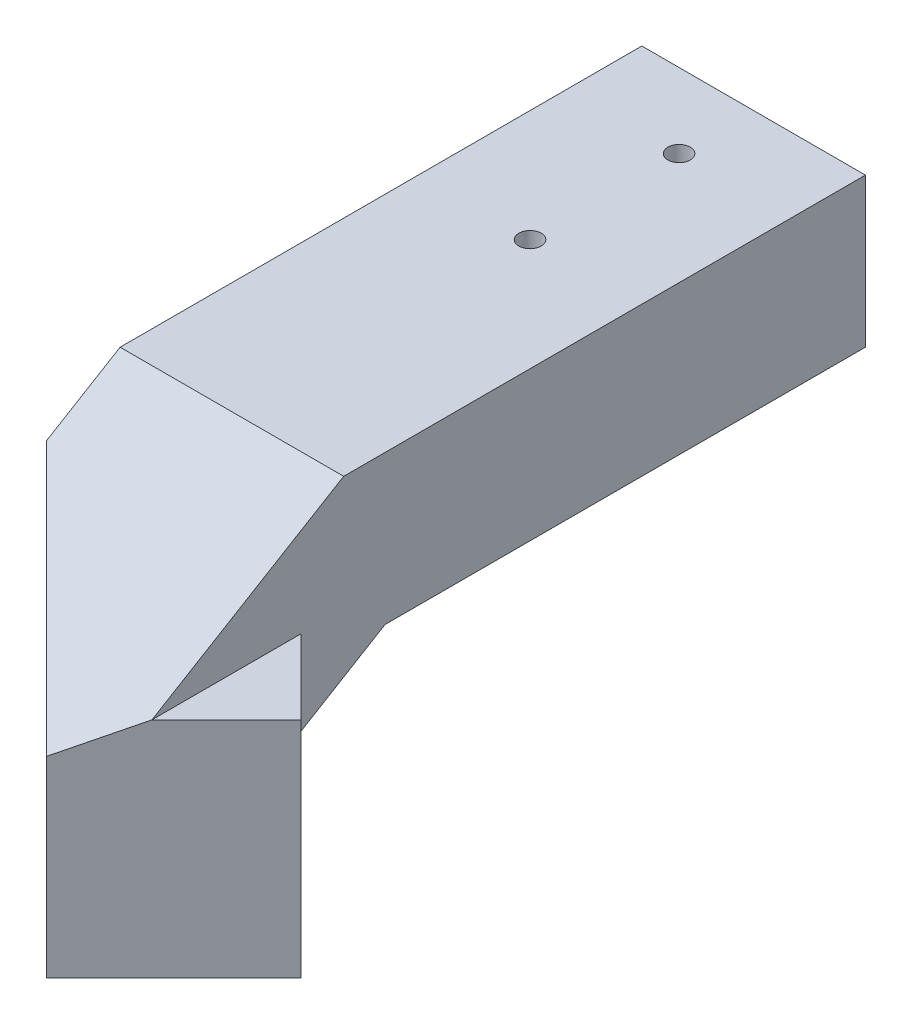
ISO-10303-21;
HEADER;
FILE_DESCRIPTION(('STEP AP214'),'2;1');
FILE_NAME('part.step','',(''),(''),'','','');
FILE_SCHEMA(('AUTOMOTIVE_DESIGN { 1 0 10303 214 1 1 1 1 }'));
ENDSEC;
DATA;
#1=APPLICATION_CONTEXT('core data for automotive mechanical design processes');
#2=APPLICATION_PROTOCOL_DEFINITION('international standard','automotive_design',2000,#1);
#3=PRODUCT_CONTEXT('',#1,'mechanical');
#4=PRODUCT('Part','Part','',(#3));
#5=PRODUCT_RELATED_PRODUCT_CATEGORY('part','',(#4));
#6=PRODUCT_DEFINITION_FORMATION('','',#4);
#7=PRODUCT_DEFINITION_CONTEXT('part definition',#1,'design');
#8=PRODUCT_DEFINITION('design','',#6,#7);
#9=PRODUCT_DEFINITION_SHAPE('','',#8);
#10=(LENGTH_UNIT() NAMED_UNIT(*) SI_UNIT(.MILLI.,.METRE.));
#11=(NAMED_UNIT(*) PLANE_ANGLE_UNIT() SI_UNIT($,.RADIAN.));
#12=(NAMED_UNIT(*) SI_UNIT($,.STERADIAN.) SOLID_ANGLE_UNIT());
#13=UNCERTAINTY_MEASURE_WITH_UNIT(LENGTH_MEASURE(1.E-05),#10,'distance_accuracy_value','');
#14=(GEOMETRIC_REPRESENTATION_CONTEXT(3) GLOBAL_UNCERTAINTY_ASSIGNED_CONTEXT((#13)) GLOBAL_UNIT_ASSIGNED_CONTEXT((#10,
#11,#12)) REPRESENTATION_CONTEXT('',''));
#15=CARTESIAN_POINT('',(0.,0.,0.));
#16=DIRECTION('',(0.,0.,1.));
#17=DIRECTION('',(1.,0.,0.));
#18=AXIS2_PLACEMENT_3D('',#15,#16,#17);
#19=CARTESIAN_POINT('',(30.,0.,0.));
#20=DIRECTION('',(0.,-1.,0.));
#21=DIRECTION('',(0.,0.,-1.));
#22=AXIS2_PLACEMENT_3D('',#19,#20,#21);
#23=PLANE('',#22);
#24=CARTESIAN_POINT('',(15.,0.,9.99999999999999));
#25=DIRECTION('',(0.,-1.,0.));
#26=DIRECTION('',(0.,0.,-1.));
#27=AXIS2_PLACEMENT_3D('',#24,#25,#26);
#28=CIRCLE('',#27,1.5);
#29=CARTESIAN_POINT('',(15.,0.,8.49999999999999));
#30=VERTEX_POINT('',#29);
#31=EDGE_CURVE('E262',#30,#30,#28,.T.);
#32=ORIENTED_EDGE('',*,*,#31,.T.);
#33=EDGE_LOOP('',(#32));
#34=FACE_BOUND('',#33,.T.);
#35=CARTESIAN_POINT('',(15.,0.,-10.));
#36=DIRECTION('',(0.,-1.,0.));
#37=DIRECTION('',(0.,0.,-1.));
#38=AXIS2_PLACEMENT_3D('',#35,#36,#37);
#39=CIRCLE('',#38,1.5);
#40=CARTESIAN_POINT('',(15.,0.,-11.5));
#41=VERTEX_POINT('',#40);
#42=EDGE_CURVE('E143',#41,#41,#39,.T.);
#43=ORIENTED_EDGE('',*,*,#42,.T.);
#44=EDGE_LOOP('',(#43));
#45=FACE_BOUND('',#44,.T.);
#46=DIRECTION('',(0.,0.,1.));
#47=VECTOR('',#46,1.);
#48=CARTESIAN_POINT('',(0.,0.,0.));
#49=LINE('',#48,#47);
#50=CARTESIAN_POINT('',(0.,0.,-20.));
#51=VERTEX_POINT('',#50);
#52=CARTESIAN_POINT('',(0.,0.,50.));
#53=VERTEX_POINT('',#52);
#54=EDGE_CURVE('E133',#51,#53,#49,.T.);
#55=ORIENTED_EDGE('',*,*,#54,.T.);
#56=DIRECTION('',(-1.,0.,0.));
#57=VECTOR('',#56,1.);
#58=CARTESIAN_POINT('',(30.,0.,50.));
#59=LINE('',#58,#57);
#60=CARTESIAN_POINT('',(30.,0.,50.));
#61=VERTEX_POINT('',#60);
#62=EDGE_CURVE('E218',#61,#53,#59,.T.);
#63=ORIENTED_EDGE('',*,*,#62,.F.);
#64=DIRECTION('',(0.,0.,1.));
#65=VECTOR('',#64,1.);
#66=CARTESIAN_POINT('',(30.,0.,0.));
#67=LINE('',#66,#65);
#68=CARTESIAN_POINT('',(30.,0.,-20.));
#69=VERTEX_POINT('',#68);
#70=EDGE_CURVE('E126',#69,#61,#67,.T.);
#71=ORIENTED_EDGE('',*,*,#70,.F.);
#72=DIRECTION('',(1.,0.,0.));
#73=VECTOR('',#72,1.);
#74=CARTESIAN_POINT('',(0.,0.,-20.));
#75=LINE('',#74,#73);
#76=EDGE_CURVE('E137',#51,#69,#75,.T.);
#77=ORIENTED_EDGE('',*,*,#76,.F.);
#78=EDGE_LOOP('',(#55,#63,#71,#77));
#79=FACE_BOUND('',#78,.T.);
#80=ADVANCED_FACE('F32',(#34,#45,#79),#23,.F.);
#81=CARTESIAN_POINT('',(30.,0.,50.));
#82=DIRECTION('',(0.,-0.857492925712545,-0.514495755427526));
#83=DIRECTION('',(0.,0.514495755427526,-0.857492925712545));
#84=AXIS2_PLACEMENT_3D('',#81,#82,#83);
#85=PLANE('',#84);
#86=ORIENTED_EDGE('',*,*,#62,.T.);
#87=DIRECTION('',(0.,0.514495755427526,-0.857492925712544));
#88=VECTOR('',#87,1.);
#89=CARTESIAN_POINT('',(0.,22.0588235294118,13.235294117647));
#90=LINE('',#89,#88);
#91=CARTESIAN_POINT('',(0.,-5.92015403706431,59.8669233951072));
#92=VERTEX_POINT('',#91);
#93=EDGE_CURVE('E45',#92,#53,#90,.T.);
#94=ORIENTED_EDGE('',*,*,#93,.F.);
#95=DIRECTION('',(0.650944554904118,-0.390566732942472,0.650944554904121));
#96=VECTOR('',#95,1.);
#97=CARTESIAN_POINT('',(-26.8724643293838,10.203324560566,32.9944590657233));
#98=LINE('',#97,#96);
#99=CARTESIAN_POINT('',(22.9289321881345,-19.6775133499451,82.7958555832418));
#100=VERTEX_POINT('',#99);
#101=EDGE_CURVE('E11',#92,#100,#98,.T.);
#102=ORIENTED_EDGE('',*,*,#101,.T.);
#103=DIRECTION('',(0.650944554904121,0.390566732942471,-0.650944554904118));
#104=VECTOR('',#103,1.);
#105=CARTESIAN_POINT('',(30.8474576271187,-14.9263980865546,74.8773301442577));
#106=LINE('',#105,#104);
#107=CARTESIAN_POINT('',(30.,-15.4348726628258,75.7247877713763));
#108=VERTEX_POINT('',#107);
#109=EDGE_CURVE('E152',#100,#108,#106,.T.);
#110=ORIENTED_EDGE('',*,*,#109,.T.);
#111=DIRECTION('',(0.,-0.514495755427526,0.857492925712544));
#112=VECTOR('',#111,1.);
#113=CARTESIAN_POINT('',(30.,0.,50.));
#114=LINE('',#113,#112);
#115=EDGE_CURVE('E208',#61,#108,#114,.T.);
#116=ORIENTED_EDGE('',*,*,#115,.F.);
#117=EDGE_LOOP('',(#86,#94,#102,#110,#116));
#118=FACE_BOUND('',#117,.T.);
#119=ADVANCED_FACE('F249',(#118),#85,.F.);
#120=CARTESIAN_POINT('',(30.,-45.4348726628258,75.7247877713763));
#121=DIRECTION('',(0.,1.,0.));
#122=DIRECTION('',(0.,0.,1.));
#123=AXIS2_PLACEMENT_3D('',#120,#121,#122);
#124=PLANE('',#123);
#125=DIRECTION('',(-0.707106781186549,0.,0.707106781186546));
#126=VECTOR('',#125,1.);
#127=CARTESIAN_POINT('',(40.,-45.4348726628258,65.7247877713764));
#128=LINE('',#127,#126);
#129=CARTESIAN_POINT('',(40.,-45.4348726628258,65.7247877713764));
#130=VERTEX_POINT('',#129);
#131=CARTESIAN_POINT('',(22.9289321881345,-45.4348726628258,82.7958555832418));
#132=VERTEX_POINT('',#131);
#133=EDGE_CURVE('E191',#130,#132,#128,.T.);
#134=ORIENTED_EDGE('',*,*,#133,.T.);
#135=DIRECTION('',(0.707106781186546,0.,0.707106781186549));
#136=VECTOR('',#135,1.);
#137=CARTESIAN_POINT('',(2.9289321881346,-45.4348726628258,62.7958555832418));
#138=LINE('',#137,#136);
#139=CARTESIAN_POINT('',(2.9289321881346,-45.4348726628258,62.7958555832418));
#140=VERTEX_POINT('',#139);
#141=EDGE_CURVE('E167',#140,#132,#138,.T.);
#142=ORIENTED_EDGE('',*,*,#141,.F.);
#143=DIRECTION('',(-0.707106781186549,0.,0.707106781186546));
#144=VECTOR('',#143,1.);
#145=CARTESIAN_POINT('',(20.0000000000001,-45.4348726628258,45.7247877713764));
#146=LINE('',#145,#144);
#147=CARTESIAN_POINT('',(20.0000000000001,-45.4348726628258,45.7247877713764));
#148=VERTEX_POINT('',#147);
#149=EDGE_CURVE('E186',#148,#140,#146,.T.);
#150=ORIENTED_EDGE('',*,*,#149,.F.);
#151=DIRECTION('',(0.707106781186546,0.,0.707106781186549));
#152=VECTOR('',#151,1.);
#153=CARTESIAN_POINT('',(20.0000000000001,-45.4348726628258,45.7247877713764));
#154=LINE('',#153,#152);
#155=EDGE_CURVE('E178',#148,#130,#154,.T.);
#156=ORIENTED_EDGE('',*,*,#155,.T.);
#157=EDGE_LOOP('',(#134,#142,#150,#156));
#158=FACE_BOUND('',#157,.T.);
#159=ADVANCED_FACE('F234',(#158),#124,.F.);
#160=CARTESIAN_POINT('',(30.,-20.,44.4603207010313));
#161=DIRECTION('',(0.,0.857492925712544,0.514495755427526));
#162=DIRECTION('',(0.,-0.514495755427526,0.857492925712545));
#163=AXIS2_PLACEMENT_3D('',#160,#161,#162);
#164=PLANE('',#163);
#165=DIRECTION('',(-0.650944554904118,0.390566732942472,-0.650944554904121));
#166=VECTOR('',#165,1.);
#167=CARTESIAN_POINT('',(23.5086121967503,-22.8638475602572,49.2333999681267));
#168=LINE('',#167,#166);
#169=CARTESIAN_POINT('',(30.,-26.758680242207,55.7247877713763));
#170=VERTEX_POINT('',#169);
#171=CARTESIAN_POINT('',(20.0000000000001,-20.758680242207,45.7247877713764));
#172=VERTEX_POINT('',#171);
#173=EDGE_CURVE('E196',#170,#172,#168,.T.);
#174=ORIENTED_EDGE('',*,*,#173,.T.);
#175=DIRECTION('',(-0.650944554904121,-0.390566732942471,0.650944554904118));
#176=VECTOR('',#175,1.);
#177=CARTESIAN_POINT('',(24.9659640744362,-17.7791017975454,40.7588236969403));
#178=LINE('',#177,#176);
#179=CARTESIAN_POINT('',(10.0000000000001,-26.758680242207,55.7247877713763));
#180=VERTEX_POINT('',#179);
#181=EDGE_CURVE('E201',#172,#180,#178,.T.);
#182=ORIENTED_EDGE('',*,*,#181,.T.);
#183=DIRECTION('',(-0.650944554904118,0.390566732942472,-0.650944554904121));
#184=VECTOR('',#183,1.);
#185=CARTESIAN_POINT('',(11.9831884679368,-27.948593322969,57.7079762393131));
#186=LINE('',#185,#184);
#187=CARTESIAN_POINT('',(0.,-20.7586802422069,45.7247877713762));
#188=VERTEX_POINT('',#187);
#189=EDGE_CURVE('E204',#180,#188,#186,.T.);
#190=ORIENTED_EDGE('',*,*,#189,.T.);
#191=DIRECTION('',(0.,0.514495755427526,-0.857492925712544));
#192=VECTOR('',#191,1.);
#193=CARTESIAN_POINT('',(0.,-20.,44.4603207010313));
#194=LINE('',#193,#192);
#195=CARTESIAN_POINT('',(0.,-20.,44.4603207010313));
#196=VERTEX_POINT('',#195);
#197=EDGE_CURVE('E127',#188,#196,#194,.T.);
#198=ORIENTED_EDGE('',*,*,#197,.T.);
#199=DIRECTION('',(-1.,0.,0.));
#200=VECTOR('',#199,1.);
#201=CARTESIAN_POINT('',(30.,-20.,44.4603207010313));
#202=LINE('',#201,#200);
#203=CARTESIAN_POINT('',(30.,-20.,44.4603207010313));
#204=VERTEX_POINT('',#203);
#205=EDGE_CURVE('E125',#204,#196,#202,.T.);
#206=ORIENTED_EDGE('',*,*,#205,.F.);
#207=DIRECTION('',(0.,0.514495755427526,-0.857492925712544));
#208=VECTOR('',#207,1.);
#209=CARTESIAN_POINT('',(30.,-20.,44.4603207010313));
#210=LINE('',#209,#208);
#211=EDGE_CURVE('E211',#170,#204,#210,.T.);
#212=ORIENTED_EDGE('',*,*,#211,.F.);
#213=EDGE_LOOP('',(#174,#182,#190,#198,#206,#212));
#214=FACE_BOUND('',#213,.T.);
#215=ADVANCED_FACE('F281',(#214),#164,.F.);
#216=CARTESIAN_POINT('',(30.,-20.,0.));
#217=DIRECTION('',(0.,1.,0.));
#218=DIRECTION('',(0.,0.,1.));
#219=AXIS2_PLACEMENT_3D('',#216,#217,#218);
#220=PLANE('',#219);
#221=CARTESIAN_POINT('',(15.,-20.,9.99999999999999));
#222=DIRECTION('',(0.,-1.,0.));
#223=DIRECTION('',(0.,0.,-1.));
#224=AXIS2_PLACEMENT_3D('',#221,#222,#223);
#225=CIRCLE('',#224,1.5);
#226=CARTESIAN_POINT('',(15.,-20.,8.49999999999999));
#227=VERTEX_POINT('',#226);
#228=EDGE_CURVE('E273',#227,#227,#225,.T.);
#229=ORIENTED_EDGE('',*,*,#228,.F.);
#230=EDGE_LOOP('',(#229));
#231=FACE_BOUND('',#230,.T.);
#232=CARTESIAN_POINT('',(15.,-20.,-10.));
#233=DIRECTION('',(0.,-1.,0.));
#234=DIRECTION('',(0.,0.,-1.));
#235=AXIS2_PLACEMENT_3D('',#232,#233,#234);
#236=CIRCLE('',#235,1.5);
#237=CARTESIAN_POINT('',(15.,-20.,-11.5));
#238=VERTEX_POINT('',#237);
#239=EDGE_CURVE('E146',#238,#238,#236,.T.);
#240=ORIENTED_EDGE('',*,*,#239,.F.);
#241=EDGE_LOOP('',(#240));
#242=FACE_BOUND('',#241,.T.);
#243=DIRECTION('',(0.,0.,-1.));
#244=VECTOR('',#243,1.);
#245=CARTESIAN_POINT('',(0.,-20.,0.));
#246=LINE('',#245,#244);
#247=CARTESIAN_POINT('',(0.,-20.,-20.));
#248=VERTEX_POINT('',#247);
#249=EDGE_CURVE('E118',#196,#248,#246,.T.);
#250=ORIENTED_EDGE('',*,*,#249,.T.);
#251=DIRECTION('',(-1.,0.,0.));
#252=VECTOR('',#251,1.);
#253=CARTESIAN_POINT('',(30.,-20.,-20.));
#254=LINE('',#253,#252);
#255=CARTESIAN_POINT('',(30.,-20.,-20.));
#256=VERTEX_POINT('',#255);
#257=EDGE_CURVE('E123',#256,#248,#254,.T.);
#258=ORIENTED_EDGE('',*,*,#257,.F.);
#259=DIRECTION('',(0.,0.,-1.));
#260=VECTOR('',#259,1.);
#261=CARTESIAN_POINT('',(30.,-20.,0.));
#262=LINE('',#261,#260);
#263=EDGE_CURVE('E213',#204,#256,#262,.T.);
#264=ORIENTED_EDGE('',*,*,#263,.F.);
#265=ORIENTED_EDGE('',*,*,#205,.T.);
#266=EDGE_LOOP('',(#250,#258,#264,#265));
#267=FACE_BOUND('',#266,.T.);
#268=ADVANCED_FACE('F120',(#231,#242,#267),#220,.F.);
#269=CARTESIAN_POINT('',(30.,0.,0.));
#270=DIRECTION('',(1.,0.,0.));
#271=DIRECTION('',(0.,0.,-1.));
#272=AXIS2_PLACEMENT_3D('',#269,#270,#271);
#273=PLANE('',#272);
#274=DIRECTION('',(0.,0.,1.));
#275=VECTOR('',#274,1.);
#276=CARTESIAN_POINT('',(30.,-15.4348726628258,0.));
#277=LINE('',#276,#275);
#278=CARTESIAN_POINT('',(30.,-15.4348726628258,55.7247877713763));
#279=VERTEX_POINT('',#278);
#280=EDGE_CURVE('E198',#279,#108,#277,.T.);
#281=ORIENTED_EDGE('',*,*,#280,.F.);
#282=DIRECTION('',(0.,1.,0.));
#283=VECTOR('',#282,1.);
#284=CARTESIAN_POINT('',(30.,0.,55.7247877713763));
#285=LINE('',#284,#283);
#286=EDGE_CURVE('E190',#170,#279,#285,.T.);
#287=ORIENTED_EDGE('',*,*,#286,.F.);
#288=ORIENTED_EDGE('',*,*,#211,.T.);
#289=ORIENTED_EDGE('',*,*,#263,.T.);
#290=DIRECTION('',(0.,-1.,0.));
#291=VECTOR('',#290,1.);
#292=CARTESIAN_POINT('',(30.,0.,-20.));
#293=LINE('',#292,#291);
#294=EDGE_CURVE('E142',#69,#256,#293,.T.);
#295=ORIENTED_EDGE('',*,*,#294,.F.);
#296=ORIENTED_EDGE('',*,*,#70,.T.);
#297=ORIENTED_EDGE('',*,*,#115,.T.);
#298=EDGE_LOOP('',(#281,#287,#288,#289,#295,#296,#297));
#299=FACE_BOUND('',#298,.T.);
#300=ADVANCED_FACE('F251',(#299),#273,.T.);
#301=CARTESIAN_POINT('',(0.,0.,0.));
#302=DIRECTION('',(1.,0.,0.));
#303=DIRECTION('',(0.,0.,-1.));
#304=AXIS2_PLACEMENT_3D('',#301,#302,#303);
#305=PLANE('',#304);
#306=DIRECTION('',(0.,1.,0.));
#307=VECTOR('',#306,1.);
#308=CARTESIAN_POINT('',(0.,0.,59.8669233951072));
#309=LINE('',#308,#307);
#310=CARTESIAN_POINT('',(0.,-25.0013209293262,59.8669233951072));
#311=VERTEX_POINT('',#310);
#312=EDGE_CURVE('E39',#311,#92,#309,.T.);
#313=ORIENTED_EDGE('',*,*,#312,.T.);
#314=ORIENTED_EDGE('',*,*,#93,.T.);
#315=ORIENTED_EDGE('',*,*,#54,.F.);
#316=DIRECTION('',(0.,1.,0.));
#317=VECTOR('',#316,1.);
#318=CARTESIAN_POINT('',(0.,-20.,-20.));
#319=LINE('',#318,#317);
#320=EDGE_CURVE('E130',#248,#51,#319,.T.);
#321=ORIENTED_EDGE('',*,*,#320,.F.);
#322=ORIENTED_EDGE('',*,*,#249,.F.);
#323=ORIENTED_EDGE('',*,*,#197,.F.);
#324=DIRECTION('',(0.,0.287347885566346,-0.957826285221151));
#325=VECTOR('',#324,1.);
#326=CARTESIAN_POINT('',(0.,-22.7048456950139,52.2120059473996));
#327=LINE('',#326,#325);
#328=EDGE_CURVE('E53',#311,#188,#327,.T.);
#329=ORIENTED_EDGE('',*,*,#328,.F.);
#330=EDGE_LOOP('',(#313,#314,#315,#321,#322,#323,#329));
#331=FACE_BOUND('',#330,.T.);
#332=ADVANCED_FACE('F131',(#331),#305,.F.);
#333=CARTESIAN_POINT('',(20.0000000000001,-45.4348726628258,45.7247877713764));
#334=DIRECTION('',(-0.707106781186546,0.,-0.707106781186549));
#335=DIRECTION('',(-0.707106781186549,0.,0.707106781186546));
#336=AXIS2_PLACEMENT_3D('',#333,#334,#335);
#337=PLANE('',#336);
#338=ORIENTED_EDGE('',*,*,#181,.F.);
#339=DIRECTION('',(0.,-1.,0.));
#340=VECTOR('',#339,1.);
#341=CARTESIAN_POINT('',(20.0000000000001,-45.4348726628258,45.7247877713764));
#342=LINE('',#341,#340);
#343=EDGE_CURVE('E176',#172,#148,#342,.T.);
#344=ORIENTED_EDGE('',*,*,#343,.T.);
#345=ORIENTED_EDGE('',*,*,#149,.T.);
#346=DIRECTION('',(0.,-1.,0.));
#347=VECTOR('',#346,1.);
#348=CARTESIAN_POINT('',(2.9289321881346,-26.758680242207,62.7958555832418));
#349=LINE('',#348,#347);
#350=CARTESIAN_POINT('',(2.9289321881346,-26.758680242207,62.7958555832418));
#351=VERTEX_POINT('',#350);
#352=EDGE_CURVE('E164',#351,#140,#349,.T.);
#353=ORIENTED_EDGE('',*,*,#352,.F.);
#354=DIRECTION('',(0.707106781186549,0.,-0.707106781186546));
#355=VECTOR('',#354,1.);
#356=CARTESIAN_POINT('',(2.9289321881346,-26.758680242207,62.7958555832418));
#357=LINE('',#356,#355);
#358=EDGE_CURVE('E173',#351,#180,#357,.T.);
#359=ORIENTED_EDGE('',*,*,#358,.T.);
#360=EDGE_LOOP('',(#338,#344,#345,#353,#359));
#361=FACE_BOUND('',#360,.T.);
#362=ADVANCED_FACE('F229',(#361),#337,.T.);
#363=CARTESIAN_POINT('',(-12.8623938856881,0.,12.862393885688));
#364=DIRECTION('',(0.707106781186549,0.,-0.707106781186546));
#365=DIRECTION('',(-0.707106781186546,0.,-0.707106781186549));
#366=AXIS2_PLACEMENT_3D('',#363,#364,#365);
#367=PLANE('',#366);
#368=CARTESIAN_POINT('',(30.,-35.4348726628258,55.7247877713764));
#369=DIRECTION('',(0.707106781186549,0.,-0.707106781186546));
#370=DIRECTION('',(-0.707106781186546,0.,-0.707106781186549));
#371=AXIS2_PLACEMENT_3D('',#368,#369,#370);
#372=CIRCLE('',#371,3.00000000000001);
#373=CARTESIAN_POINT('',(27.8786796564404,-35.4348726628258,53.6034674278167));
#374=VERTEX_POINT('',#373);
#375=EDGE_CURVE('E158',#374,#374,#372,.T.);
#376=ORIENTED_EDGE('',*,*,#375,.F.);
#377=EDGE_LOOP('',(#376));
#378=FACE_BOUND('',#377,.T.);
#379=ORIENTED_EDGE('',*,*,#173,.F.);
#380=ORIENTED_EDGE('',*,*,#286,.T.);
#381=DIRECTION('',(-0.707106781186546,0.,-0.707106781186549));
#382=VECTOR('',#381,1.);
#383=CARTESIAN_POINT('',(20.0000000000001,-15.4348726628258,45.7247877713764));
#384=LINE('',#383,#382);
#385=CARTESIAN_POINT('',(40.,-15.4348726628258,65.7247877713764));
#386=VERTEX_POINT('',#385);
#387=EDGE_CURVE('E183',#386,#279,#384,.T.);
#388=ORIENTED_EDGE('',*,*,#387,.F.);
#389=DIRECTION('',(0.,1.,0.));
#390=VECTOR('',#389,1.);
#391=CARTESIAN_POINT('',(40.,-45.4348726628258,65.7247877713764));
#392=LINE('',#391,#390);
#393=EDGE_CURVE('E180',#130,#386,#392,.T.);
#394=ORIENTED_EDGE('',*,*,#393,.F.);
#395=ORIENTED_EDGE('',*,*,#155,.F.);
#396=ORIENTED_EDGE('',*,*,#343,.F.);
#397=EDGE_LOOP('',(#379,#380,#388,#394,#395,#396));
#398=FACE_BOUND('',#397,.T.);
#399=ADVANCED_FACE('F244',(#378,#398),#367,.T.);
#400=CARTESIAN_POINT('',(20.0000000000001,-15.4348726628258,45.7247877713764));
#401=DIRECTION('',(0.,1.,0.));
#402=DIRECTION('',(0.,0.,1.));
#403=AXIS2_PLACEMENT_3D('',#400,#401,#402);
#404=PLANE('',#403);
#405=ORIENTED_EDGE('',*,*,#387,.T.);
#406=ORIENTED_EDGE('',*,*,#280,.T.);
#407=DIRECTION('',(-0.707106781186549,0.,0.707106781186546));
#408=VECTOR('',#407,1.);
#409=CARTESIAN_POINT('',(40.,-15.4348726628258,65.7247877713764));
#410=LINE('',#409,#408);
#411=EDGE_CURVE('E187',#386,#108,#410,.T.);
#412=ORIENTED_EDGE('',*,*,#411,.F.);
#413=EDGE_LOOP('',(#405,#406,#412));
#414=FACE_BOUND('',#413,.T.);
#415=ADVANCED_FACE('F247',(#414),#404,.T.);
#416=CARTESIAN_POINT('',(40.,-45.4348726628258,65.7247877713764));
#417=DIRECTION('',(0.707106781186546,0.,0.707106781186549));
#418=DIRECTION('',(0.707106781186549,0.,-0.707106781186546));
#419=AXIS2_PLACEMENT_3D('',#416,#417,#418);
#420=PLANE('',#419);
#421=ORIENTED_EDGE('',*,*,#109,.F.);
#422=DIRECTION('',(0.,1.,0.));
#423=VECTOR('',#422,1.);
#424=CARTESIAN_POINT('',(22.9289321881345,-45.4348726628258,82.7958555832418));
#425=LINE('',#424,#423);
#426=EDGE_CURVE('E170',#132,#100,#425,.T.);
#427=ORIENTED_EDGE('',*,*,#426,.F.);
#428=ORIENTED_EDGE('',*,*,#133,.F.);
#429=ORIENTED_EDGE('',*,*,#393,.T.);
#430=ORIENTED_EDGE('',*,*,#411,.T.);
#431=EDGE_LOOP('',(#421,#427,#428,#429,#430));
#432=FACE_BOUND('',#431,.T.);
#433=ADVANCED_FACE('F240',(#432),#420,.T.);
#434=CARTESIAN_POINT('',(-7.07106781186549,-20.7586802422069,52.7958555832417));
#435=DIRECTION('',(0.276172385369497,0.920574617898323,0.276172385369498));
#436=DIRECTION('',(0.,-0.287347885566346,0.957826285221151));
#437=AXIS2_PLACEMENT_3D('',#434,#435,#436);
#438=PLANE('',#437);
#439=DIRECTION('',(0.650944554904118,-0.390566732942472,0.65094455490412));
#440=VECTOR('',#439,1.);
#441=CARTESIAN_POINT('',(-7.07106781186549,-20.7586802422069,52.7958555832417));
#442=LINE('',#441,#440);
#443=EDGE_CURVE('E162',#311,#351,#442,.T.);
#444=ORIENTED_EDGE('',*,*,#443,.F.);
#445=ORIENTED_EDGE('',*,*,#328,.T.);
#446=ORIENTED_EDGE('',*,*,#189,.F.);
#447=ORIENTED_EDGE('',*,*,#358,.F.);
#448=EDGE_LOOP('',(#444,#445,#446,#447));
#449=FACE_BOUND('',#448,.T.);
#450=ADVANCED_FACE('F225',(#449),#438,.F.);
#451=CARTESIAN_POINT('',(-29.9334616975536,0.,29.9334616975535));
#452=DIRECTION('',(-0.707106781186549,0.,0.707106781186546));
#453=DIRECTION('',(0.707106781186546,0.,0.707106781186549));
#454=AXIS2_PLACEMENT_3D('',#451,#452,#453);
#455=PLANE('',#454);
#456=ORIENTED_EDGE('',*,*,#101,.F.);
#457=ORIENTED_EDGE('',*,*,#312,.F.);
#458=ORIENTED_EDGE('',*,*,#443,.T.);
#459=ORIENTED_EDGE('',*,*,#352,.T.);
#460=ORIENTED_EDGE('',*,*,#141,.T.);
#461=ORIENTED_EDGE('',*,*,#426,.T.);
#462=EDGE_LOOP('',(#456,#457,#458,#459,#460,#461));
#463=FACE_BOUND('',#462,.T.);
#464=CARTESIAN_POINT('',(12.9289321881345,-35.4348726628258,72.7958555832418));
#465=DIRECTION('',(-0.707106781186549,0.,0.707106781186546));
#466=DIRECTION('',(0.707106781186546,0.,0.707106781186549));
#467=AXIS2_PLACEMENT_3D('',#464,#465,#466);
#468=CIRCLE('',#467,3.00000000000001);
#469=CARTESIAN_POINT('',(15.0502525316942,-35.4348726628258,74.9171759268014));
#470=VERTEX_POINT('',#469);
#471=EDGE_CURVE('E155',#470,#470,#468,.T.);
#472=ORIENTED_EDGE('',*,*,#471,.F.);
#473=EDGE_LOOP('',(#472));
#474=FACE_BOUND('',#473,.T.);
#475=ADVANCED_FACE('F221',(#463,#474),#455,.T.);
#476=CARTESIAN_POINT('',(62.8623938856882,-35.4348726628258,22.8623938856883));
#477=DIRECTION('',(-0.707106781186549,0.,0.707106781186546));
#478=DIRECTION('',(0.707106781186546,0.,0.707106781186549));
#479=AXIS2_PLACEMENT_3D('',#476,#477,#478);
#480=CYLINDRICAL_SURFACE('',#479,3.00000000000001);
#481=ORIENTED_EDGE('',*,*,#375,.T.);
#482=EDGE_LOOP('',(#481));
#483=FACE_BOUND('',#482,.T.);
#484=ORIENTED_EDGE('',*,*,#471,.T.);
#485=EDGE_LOOP('',(#484));
#486=FACE_BOUND('',#485,.T.);
#487=ADVANCED_FACE('F336',(#483,#486),#480,.F.);
#488=CARTESIAN_POINT('',(0.,0.,-20.));
#489=DIRECTION('',(0.,0.,-1.));
#490=DIRECTION('',(-1.,0.,0.));
#491=AXIS2_PLACEMENT_3D('',#488,#489,#490);
#492=PLANE('',#491);
#493=ORIENTED_EDGE('',*,*,#257,.T.);
#494=ORIENTED_EDGE('',*,*,#320,.T.);
#495=ORIENTED_EDGE('',*,*,#76,.T.);
#496=ORIENTED_EDGE('',*,*,#294,.T.);
#497=EDGE_LOOP('',(#493,#494,#495,#496));
#498=FACE_BOUND('',#497,.T.);
#499=ADVANCED_FACE('F140',(#498),#492,.T.);
#500=CARTESIAN_POINT('',(15.,0.,-10.));
#501=DIRECTION('',(0.,-1.,0.));
#502=DIRECTION('',(0.,0.,-1.));
#503=AXIS2_PLACEMENT_3D('',#500,#501,#502);
#504=CYLINDRICAL_SURFACE('',#503,1.5);
#505=ORIENTED_EDGE('',*,*,#42,.F.);
#506=EDGE_LOOP('',(#505));
#507=FACE_BOUND('',#506,.T.);
#508=ORIENTED_EDGE('',*,*,#239,.T.);
#509=EDGE_LOOP('',(#508));
#510=FACE_BOUND('',#509,.T.);
#511=ADVANCED_FACE('F265',(#507,#510),#504,.F.);
#512=CARTESIAN_POINT('',(15.,0.,9.99999999999999));
#513=DIRECTION('',(0.,-1.,0.));
#514=DIRECTION('',(0.,0.,-1.));
#515=AXIS2_PLACEMENT_3D('',#512,#513,#514);
#516=CYLINDRICAL_SURFACE('',#515,1.5);
#517=ORIENTED_EDGE('',*,*,#31,.F.);
#518=EDGE_LOOP('',(#517));
#519=FACE_BOUND('',#518,.T.);
#520=ORIENTED_EDGE('',*,*,#228,.T.);
#521=EDGE_LOOP('',(#520));
#522=FACE_BOUND('',#521,.T.);
#523=ADVANCED_FACE('F268',(#519,#522),#516,.F.);
#524=CLOSED_SHELL('',(#80,#119,#159,#215,#268,#300,#332,#362,#399,#415,#433,#450,#475,#487,#499,
#511,#523));
#525=MANIFOLD_SOLID_BREP('B2',#524);
#526=ADVANCED_BREP_SHAPE_REPRESENTATION('',(#18,#525),#14);
#527=SHAPE_DEFINITION_REPRESENTATION(#9,#526);
ENDSEC;
END-ISO-10303-21;
